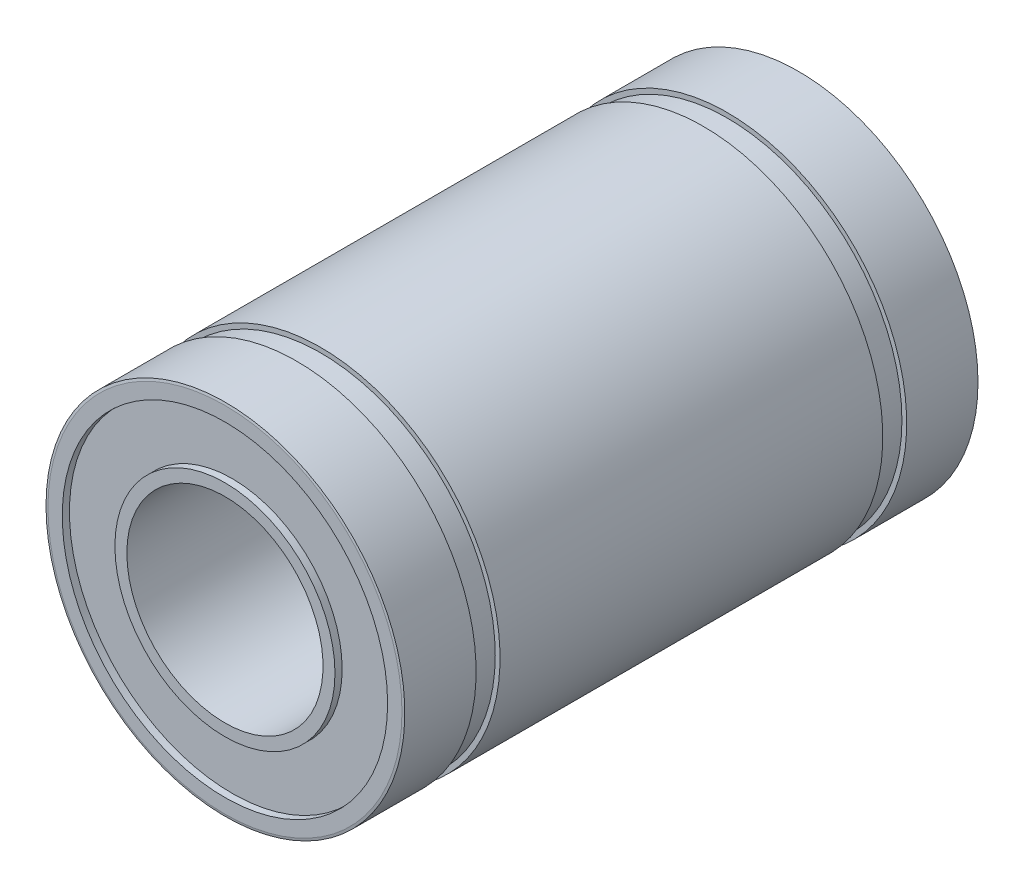
ISO-10303-21;
HEADER;
FILE_DESCRIPTION(('STEP AP214'),'2;1');
FILE_NAME('part.step','',(''),(''),'','','');
FILE_SCHEMA(('AUTOMOTIVE_DESIGN { 1 0 10303 214 1 1 1 1 }'));
ENDSEC;
DATA;
#1=APPLICATION_CONTEXT('core data for automotive mechanical design processes');
#2=APPLICATION_PROTOCOL_DEFINITION('international standard','automotive_design',2000,#1);
#3=PRODUCT_CONTEXT('',#1,'mechanical');
#4=PRODUCT('Part','Part','',(#3));
#5=PRODUCT_RELATED_PRODUCT_CATEGORY('part','',(#4));
#6=PRODUCT_DEFINITION_FORMATION('','',#4);
#7=PRODUCT_DEFINITION_CONTEXT('part definition',#1,'design');
#8=PRODUCT_DEFINITION('design','',#6,#7);
#9=PRODUCT_DEFINITION_SHAPE('','',#8);
#10=(LENGTH_UNIT() NAMED_UNIT(*) SI_UNIT(.MILLI.,.METRE.));
#11=(NAMED_UNIT(*) PLANE_ANGLE_UNIT() SI_UNIT($,.RADIAN.));
#12=(NAMED_UNIT(*) SI_UNIT($,.STERADIAN.) SOLID_ANGLE_UNIT());
#13=UNCERTAINTY_MEASURE_WITH_UNIT(LENGTH_MEASURE(1.E-05),#10,'distance_accuracy_value','');
#14=(GEOMETRIC_REPRESENTATION_CONTEXT(3) GLOBAL_UNCERTAINTY_ASSIGNED_CONTEXT((#13)) GLOBAL_UNIT_ASSIGNED_CONTEXT((#10,
#11,#12)) REPRESENTATION_CONTEXT('',''));
#15=CARTESIAN_POINT('',(0.,0.,0.));
#16=DIRECTION('',(0.,0.,1.));
#17=DIRECTION('',(1.,0.,0.));
#18=AXIS2_PLACEMENT_3D('',#15,#16,#17);
#19=CARTESIAN_POINT('',(0.,0.,24.));
#20=DIRECTION('',(0.,0.,-1.));
#21=DIRECTION('',(-1.,0.,0.));
#22=AXIS2_PLACEMENT_3D('',#19,#20,#21);
#23=CYLINDRICAL_SURFACE('',#22,4.1);
#24=CARTESIAN_POINT('',(0.,0.,0.));
#25=DIRECTION('',(0.,0.,-1.));
#26=DIRECTION('',(-1.,0.,0.));
#27=AXIS2_PLACEMENT_3D('',#24,#25,#26);
#28=CIRCLE('',#27,4.1);
#29=CARTESIAN_POINT('',(-4.1,0.,0.));
#30=VERTEX_POINT('',#29);
#31=EDGE_CURVE('E89',#30,#30,#28,.T.);
#32=ORIENTED_EDGE('',*,*,#31,.T.);
#33=EDGE_LOOP('',(#32));
#34=FACE_BOUND('',#33,.T.);
#35=CARTESIAN_POINT('',(0.,0.,24.));
#36=DIRECTION('',(0.,0.,-1.));
#37=DIRECTION('',(-1.,0.,0.));
#38=AXIS2_PLACEMENT_3D('',#35,#36,#37);
#39=CIRCLE('',#38,4.1);
#40=CARTESIAN_POINT('',(-4.1,0.,24.));
#41=VERTEX_POINT('',#40);
#42=EDGE_CURVE('E27',#41,#41,#39,.T.);
#43=ORIENTED_EDGE('',*,*,#42,.F.);
#44=EDGE_LOOP('',(#43));
#45=FACE_BOUND('',#44,.T.);
#46=ADVANCED_FACE('F24',(#34,#45),#23,.F.);
#47=CARTESIAN_POINT('',(0.,0.,24.));
#48=DIRECTION('',(0.,0.,1.));
#49=DIRECTION('',(1.,0.,0.));
#50=AXIS2_PLACEMENT_3D('',#47,#48,#49);
#51=PLANE('',#50);
#52=CARTESIAN_POINT('',(0.,0.,24.));
#53=DIRECTION('',(0.,0.,1.));
#54=DIRECTION('',(1.,0.,0.));
#55=AXIS2_PLACEMENT_3D('',#52,#53,#54);
#56=CIRCLE('',#55,4.6);
#57=CARTESIAN_POINT('',(4.6,0.,24.));
#58=VERTEX_POINT('',#57);
#59=EDGE_CURVE('E87',#58,#58,#56,.F.);
#60=ORIENTED_EDGE('',*,*,#59,.F.);
#61=EDGE_LOOP('',(#60));
#62=FACE_BOUND('',#61,.T.);
#63=ORIENTED_EDGE('',*,*,#42,.T.);
#64=EDGE_LOOP('',(#63));
#65=FACE_BOUND('',#64,.T.);
#66=ADVANCED_FACE('F96',(#62,#65),#51,.T.);
#67=CARTESIAN_POINT('',(0.,0.,0.));
#68=DIRECTION('',(0.,0.,1.));
#69=DIRECTION('',(1.,0.,0.));
#70=AXIS2_PLACEMENT_3D('',#67,#68,#69);
#71=PLANE('',#70);
#72=CARTESIAN_POINT('',(0.,0.,0.));
#73=DIRECTION('',(0.,0.,1.));
#74=DIRECTION('',(1.,0.,0.));
#75=AXIS2_PLACEMENT_3D('',#72,#73,#74);
#76=CIRCLE('',#75,4.6);
#77=CARTESIAN_POINT('',(4.6,0.,0.));
#78=VERTEX_POINT('',#77);
#79=EDGE_CURVE('E84',#78,#78,#76,.T.);
#80=ORIENTED_EDGE('',*,*,#79,.F.);
#81=EDGE_LOOP('',(#80));
#82=FACE_BOUND('',#81,.T.);
#83=ORIENTED_EDGE('',*,*,#31,.F.);
#84=EDGE_LOOP('',(#83));
#85=FACE_BOUND('',#84,.T.);
#86=ADVANCED_FACE('F102',(#82,#85),#71,.F.);
#87=CARTESIAN_POINT('',(0.,0.,24.));
#88=DIRECTION('',(0.,0.,1.));
#89=DIRECTION('',(1.,0.,0.));
#90=AXIS2_PLACEMENT_3D('',#87,#88,#89);
#91=CYLINDRICAL_SURFACE('',#90,4.6);
#92=CARTESIAN_POINT('',(0.,0.,23.7));
#93=DIRECTION('',(0.,0.,1.));
#94=DIRECTION('',(1.,0.,0.));
#95=AXIS2_PLACEMENT_3D('',#92,#93,#94);
#96=CIRCLE('',#95,4.6);
#97=CARTESIAN_POINT('',(4.6,0.,23.7));
#98=VERTEX_POINT('',#97);
#99=EDGE_CURVE('E81',#98,#98,#96,.F.);
#100=ORIENTED_EDGE('',*,*,#99,.F.);
#101=EDGE_LOOP('',(#100));
#102=FACE_BOUND('',#101,.T.);
#103=ORIENTED_EDGE('',*,*,#59,.T.);
#104=EDGE_LOOP('',(#103));
#105=FACE_BOUND('',#104,.T.);
#106=ADVANCED_FACE('F178',(#102,#105),#91,.T.);
#107=CARTESIAN_POINT('',(0.,0.,24.));
#108=DIRECTION('',(0.,0.,1.));
#109=DIRECTION('',(1.,0.,0.));
#110=AXIS2_PLACEMENT_3D('',#107,#108,#109);
#111=CYLINDRICAL_SURFACE('',#110,4.6);
#112=ORIENTED_EDGE('',*,*,#79,.T.);
#113=EDGE_LOOP('',(#112));
#114=FACE_BOUND('',#113,.T.);
#115=CARTESIAN_POINT('',(0.,0.,0.300000000000002));
#116=DIRECTION('',(0.,0.,1.));
#117=DIRECTION('',(1.,0.,0.));
#118=AXIS2_PLACEMENT_3D('',#115,#116,#117);
#119=CIRCLE('',#118,4.6);
#120=CARTESIAN_POINT('',(4.6,0.,0.300000000000002));
#121=VERTEX_POINT('',#120);
#122=EDGE_CURVE('E78',#121,#121,#119,.T.);
#123=ORIENTED_EDGE('',*,*,#122,.F.);
#124=EDGE_LOOP('',(#123));
#125=FACE_BOUND('',#124,.T.);
#126=ADVANCED_FACE('F174',(#114,#125),#111,.T.);
#127=CARTESIAN_POINT('',(-6.8,0.,23.7));
#128=DIRECTION('',(0.,0.,1.));
#129=DIRECTION('',(1.,0.,0.));
#130=AXIS2_PLACEMENT_3D('',#127,#128,#129);
#131=PLANE('',#130);
#132=ORIENTED_EDGE('',*,*,#99,.T.);
#133=EDGE_LOOP('',(#132));
#134=FACE_BOUND('',#133,.T.);
#135=CARTESIAN_POINT('',(0.,0.,23.7));
#136=DIRECTION('',(0.,0.,1.));
#137=DIRECTION('',(1.,0.,0.));
#138=AXIS2_PLACEMENT_3D('',#135,#136,#137);
#139=CIRCLE('',#138,6.8);
#140=CARTESIAN_POINT('',(6.8,0.,23.7));
#141=VERTEX_POINT('',#140);
#142=EDGE_CURVE('E75',#141,#141,#139,.T.);
#143=ORIENTED_EDGE('',*,*,#142,.T.);
#144=EDGE_LOOP('',(#143));
#145=FACE_BOUND('',#144,.T.);
#146=ADVANCED_FACE('F170',(#134,#145),#131,.T.);
#147=CARTESIAN_POINT('',(-6.8,0.,0.3));
#148=DIRECTION('',(0.,0.,-1.));
#149=DIRECTION('',(-1.,0.,0.));
#150=AXIS2_PLACEMENT_3D('',#147,#148,#149);
#151=PLANE('',#150);
#152=CARTESIAN_POINT('',(0.,0.,0.300000000000002));
#153=DIRECTION('',(0.,0.,1.));
#154=DIRECTION('',(1.,0.,0.));
#155=AXIS2_PLACEMENT_3D('',#152,#153,#154);
#156=CIRCLE('',#155,6.8);
#157=CARTESIAN_POINT('',(6.8,0.,0.300000000000002));
#158=VERTEX_POINT('',#157);
#159=EDGE_CURVE('E72',#158,#158,#156,.F.);
#160=ORIENTED_EDGE('',*,*,#159,.T.);
#161=EDGE_LOOP('',(#160));
#162=FACE_BOUND('',#161,.T.);
#163=ORIENTED_EDGE('',*,*,#122,.T.);
#164=EDGE_LOOP('',(#163));
#165=FACE_BOUND('',#164,.T.);
#166=ADVANCED_FACE('F166',(#162,#165),#151,.T.);
#167=CARTESIAN_POINT('',(0.,0.,24.));
#168=DIRECTION('',(0.,0.,1.));
#169=DIRECTION('',(1.,0.,0.));
#170=AXIS2_PLACEMENT_3D('',#167,#168,#169);
#171=CYLINDRICAL_SURFACE('',#170,6.8);
#172=CARTESIAN_POINT('',(0.,0.,24.));
#173=DIRECTION('',(0.,0.,1.));
#174=DIRECTION('',(1.,0.,0.));
#175=AXIS2_PLACEMENT_3D('',#172,#173,#174);
#176=CIRCLE('',#175,6.8);
#177=CARTESIAN_POINT('',(6.8,0.,24.));
#178=VERTEX_POINT('',#177);
#179=EDGE_CURVE('E69',#178,#178,#176,.F.);
#180=ORIENTED_EDGE('',*,*,#179,.F.);
#181=EDGE_LOOP('',(#180));
#182=FACE_BOUND('',#181,.T.);
#183=ORIENTED_EDGE('',*,*,#142,.F.);
#184=EDGE_LOOP('',(#183));
#185=FACE_BOUND('',#184,.T.);
#186=ADVANCED_FACE('F162',(#182,#185),#171,.F.);
#187=CARTESIAN_POINT('',(0.,0.,24.));
#188=DIRECTION('',(0.,0.,1.));
#189=DIRECTION('',(1.,0.,0.));
#190=AXIS2_PLACEMENT_3D('',#187,#188,#189);
#191=CYLINDRICAL_SURFACE('',#190,6.8);
#192=CARTESIAN_POINT('',(0.,0.,0.));
#193=DIRECTION('',(0.,0.,1.));
#194=DIRECTION('',(1.,0.,0.));
#195=AXIS2_PLACEMENT_3D('',#192,#193,#194);
#196=CIRCLE('',#195,6.8);
#197=CARTESIAN_POINT('',(6.8,0.,0.));
#198=VERTEX_POINT('',#197);
#199=EDGE_CURVE('E66',#198,#198,#196,.F.);
#200=ORIENTED_EDGE('',*,*,#199,.T.);
#201=EDGE_LOOP('',(#200));
#202=FACE_BOUND('',#201,.T.);
#203=ORIENTED_EDGE('',*,*,#159,.F.);
#204=EDGE_LOOP('',(#203));
#205=FACE_BOUND('',#204,.T.);
#206=ADVANCED_FACE('F158',(#202,#205),#191,.F.);
#207=CARTESIAN_POINT('',(0.,0.,24.));
#208=DIRECTION('',(0.,0.,1.));
#209=DIRECTION('',(1.,0.,0.));
#210=AXIS2_PLACEMENT_3D('',#207,#208,#209);
#211=PLANE('',#210);
#212=CARTESIAN_POINT('',(0.,0.,24.));
#213=DIRECTION('',(0.,0.,-1.));
#214=DIRECTION('',(-1.,0.,0.));
#215=AXIS2_PLACEMENT_3D('',#212,#213,#214);
#216=CIRCLE('',#215,7.4);
#217=CARTESIAN_POINT('',(-7.4,0.,24.));
#218=VERTEX_POINT('',#217);
#219=EDGE_CURVE('E63',#218,#218,#216,.T.);
#220=ORIENTED_EDGE('',*,*,#219,.F.);
#221=EDGE_LOOP('',(#220));
#222=FACE_BOUND('',#221,.T.);
#223=ORIENTED_EDGE('',*,*,#179,.T.);
#224=EDGE_LOOP('',(#223));
#225=FACE_BOUND('',#224,.T.);
#226=ADVANCED_FACE('F154',(#222,#225),#211,.T.);
#227=CARTESIAN_POINT('',(0.,0.,0.));
#228=DIRECTION('',(0.,0.,1.));
#229=DIRECTION('',(1.,0.,0.));
#230=AXIS2_PLACEMENT_3D('',#227,#228,#229);
#231=PLANE('',#230);
#232=CARTESIAN_POINT('',(0.,0.,0.));
#233=DIRECTION('',(0.,0.,1.));
#234=DIRECTION('',(1.,0.,0.));
#235=AXIS2_PLACEMENT_3D('',#232,#233,#234);
#236=CIRCLE('',#235,7.4);
#237=CARTESIAN_POINT('',(7.4,0.,0.));
#238=VERTEX_POINT('',#237);
#239=EDGE_CURVE('E60',#238,#238,#236,.T.);
#240=ORIENTED_EDGE('',*,*,#239,.F.);
#241=EDGE_LOOP('',(#240));
#242=FACE_BOUND('',#241,.T.);
#243=ORIENTED_EDGE('',*,*,#199,.F.);
#244=EDGE_LOOP('',(#243));
#245=FACE_BOUND('',#244,.T.);
#246=ADVANCED_FACE('F150',(#242,#245),#231,.F.);
#247=CARTESIAN_POINT('',(0.,0.,23.98));
#248=DIRECTION('',(0.,0.,-1.));
#249=DIRECTION('',(-1.,0.,0.));
#250=AXIS2_PLACEMENT_3D('',#247,#248,#249);
#251=CONICAL_SURFACE('',#250,7.5,1.37340076694502);
#252=ORIENTED_EDGE('',*,*,#219,.T.);
#253=EDGE_LOOP('',(#252));
#254=FACE_BOUND('',#253,.T.);
#255=CARTESIAN_POINT('',(0.,0.,23.98));
#256=DIRECTION('',(0.,0.,-1.));
#257=DIRECTION('',(-1.,0.,0.));
#258=AXIS2_PLACEMENT_3D('',#255,#256,#257);
#259=CIRCLE('',#258,7.5);
#260=CARTESIAN_POINT('',(-7.5,0.,23.98));
#261=VERTEX_POINT('',#260);
#262=EDGE_CURVE('E39',#261,#261,#259,.T.);
#263=ORIENTED_EDGE('',*,*,#262,.F.);
#264=EDGE_LOOP('',(#263));
#265=FACE_BOUND('',#264,.T.);
#266=ADVANCED_FACE('F146',(#254,#265),#251,.T.);
#267=CARTESIAN_POINT('',(0.,0.,0.0199999999999992));
#268=DIRECTION('',(0.,0.,1.));
#269=DIRECTION('',(1.,0.,0.));
#270=AXIS2_PLACEMENT_3D('',#267,#268,#269);
#271=CONICAL_SURFACE('',#270,7.5,1.37340076694502);
#272=CARTESIAN_POINT('',(0.,0.,0.0199999999999992));
#273=DIRECTION('',(0.,0.,-1.));
#274=DIRECTION('',(-1.,0.,0.));
#275=AXIS2_PLACEMENT_3D('',#272,#273,#274);
#276=CIRCLE('',#275,7.5);
#277=CARTESIAN_POINT('',(-7.5,0.,0.0199999999999992));
#278=VERTEX_POINT('',#277);
#279=EDGE_CURVE('E59',#278,#278,#276,.F.);
#280=ORIENTED_EDGE('',*,*,#279,.F.);
#281=EDGE_LOOP('',(#280));
#282=FACE_BOUND('',#281,.T.);
#283=ORIENTED_EDGE('',*,*,#239,.T.);
#284=EDGE_LOOP('',(#283));
#285=FACE_BOUND('',#284,.T.);
#286=ADVANCED_FACE('F142',(#282,#285),#271,.T.);
#287=CARTESIAN_POINT('',(0.,0.,24.));
#288=DIRECTION('',(0.,0.,-1.));
#289=DIRECTION('',(-1.,0.,0.));
#290=AXIS2_PLACEMENT_3D('',#287,#288,#289);
#291=CYLINDRICAL_SURFACE('',#290,7.5);
#292=ORIENTED_EDGE('',*,*,#262,.T.);
#293=EDGE_LOOP('',(#292));
#294=FACE_BOUND('',#293,.T.);
#295=CARTESIAN_POINT('',(0.,0.,21.));
#296=DIRECTION('',(0.,0.,-1.));
#297=DIRECTION('',(-1.,0.,0.));
#298=AXIS2_PLACEMENT_3D('',#295,#296,#297);
#299=CIRCLE('',#298,7.5);
#300=CARTESIAN_POINT('',(-7.5,0.,21.));
#301=VERTEX_POINT('',#300);
#302=EDGE_CURVE('E56',#301,#301,#299,.T.);
#303=ORIENTED_EDGE('',*,*,#302,.F.);
#304=EDGE_LOOP('',(#303));
#305=FACE_BOUND('',#304,.T.);
#306=ADVANCED_FACE('F138',(#294,#305),#291,.T.);
#307=CARTESIAN_POINT('',(0.,0.,24.));
#308=DIRECTION('',(0.,0.,-1.));
#309=DIRECTION('',(-1.,0.,0.));
#310=AXIS2_PLACEMENT_3D('',#307,#308,#309);
#311=CYLINDRICAL_SURFACE('',#310,7.5);
#312=ORIENTED_EDGE('',*,*,#279,.T.);
#313=EDGE_LOOP('',(#312));
#314=FACE_BOUND('',#313,.T.);
#315=CARTESIAN_POINT('',(0.,0.,3.));
#316=DIRECTION('',(0.,0.,-1.));
#317=DIRECTION('',(-1.,0.,0.));
#318=AXIS2_PLACEMENT_3D('',#315,#316,#317);
#319=CIRCLE('',#318,7.5);
#320=CARTESIAN_POINT('',(-7.5,0.,3.));
#321=VERTEX_POINT('',#320);
#322=EDGE_CURVE('E53',#321,#321,#319,.F.);
#323=ORIENTED_EDGE('',*,*,#322,.F.);
#324=EDGE_LOOP('',(#323));
#325=FACE_BOUND('',#324,.T.);
#326=ADVANCED_FACE('F134',(#314,#325),#311,.T.);
#327=CARTESIAN_POINT('',(-7.7,0.,21.));
#328=DIRECTION('',(0.,0.,-1.));
#329=DIRECTION('',(-1.,0.,0.));
#330=AXIS2_PLACEMENT_3D('',#327,#328,#329);
#331=PLANE('',#330);
#332=ORIENTED_EDGE('',*,*,#302,.T.);
#333=EDGE_LOOP('',(#332));
#334=FACE_BOUND('',#333,.T.);
#335=CARTESIAN_POINT('',(0.,0.,21.));
#336=DIRECTION('',(0.,0.,1.));
#337=DIRECTION('',(1.,0.,0.));
#338=AXIS2_PLACEMENT_3D('',#335,#336,#337);
#339=CIRCLE('',#338,7.3);
#340=CARTESIAN_POINT('',(7.3,0.,21.));
#341=VERTEX_POINT('',#340);
#342=EDGE_CURVE('E50',#341,#341,#339,.F.);
#343=ORIENTED_EDGE('',*,*,#342,.F.);
#344=EDGE_LOOP('',(#343));
#345=FACE_BOUND('',#344,.T.);
#346=ADVANCED_FACE('F130',(#334,#345),#331,.T.);
#347=CARTESIAN_POINT('',(-7.7,0.,3.));
#348=DIRECTION('',(0.,0.,1.));
#349=DIRECTION('',(1.,0.,0.));
#350=AXIS2_PLACEMENT_3D('',#347,#348,#349);
#351=PLANE('',#350);
#352=ORIENTED_EDGE('',*,*,#322,.T.);
#353=EDGE_LOOP('',(#352));
#354=FACE_BOUND('',#353,.T.);
#355=CARTESIAN_POINT('',(0.,0.,3.));
#356=DIRECTION('',(0.,0.,1.));
#357=DIRECTION('',(1.,0.,0.));
#358=AXIS2_PLACEMENT_3D('',#355,#356,#357);
#359=CIRCLE('',#358,7.3);
#360=CARTESIAN_POINT('',(7.3,0.,3.));
#361=VERTEX_POINT('',#360);
#362=EDGE_CURVE('E47',#361,#361,#359,.T.);
#363=ORIENTED_EDGE('',*,*,#362,.F.);
#364=EDGE_LOOP('',(#363));
#365=FACE_BOUND('',#364,.T.);
#366=ADVANCED_FACE('F126',(#354,#365),#351,.T.);
#367=CARTESIAN_POINT('',(0.,0.,24.));
#368=DIRECTION('',(0.,0.,1.));
#369=DIRECTION('',(1.,0.,0.));
#370=AXIS2_PLACEMENT_3D('',#367,#368,#369);
#371=CYLINDRICAL_SURFACE('',#370,7.3);
#372=CARTESIAN_POINT('',(0.,0.,20.));
#373=DIRECTION('',(0.,0.,1.));
#374=DIRECTION('',(1.,0.,0.));
#375=AXIS2_PLACEMENT_3D('',#372,#373,#374);
#376=CIRCLE('',#375,7.3);
#377=CARTESIAN_POINT('',(7.3,0.,20.));
#378=VERTEX_POINT('',#377);
#379=EDGE_CURVE('E44',#378,#378,#376,.F.);
#380=ORIENTED_EDGE('',*,*,#379,.F.);
#381=EDGE_LOOP('',(#380));
#382=FACE_BOUND('',#381,.T.);
#383=ORIENTED_EDGE('',*,*,#342,.T.);
#384=EDGE_LOOP('',(#383));
#385=FACE_BOUND('',#384,.T.);
#386=ADVANCED_FACE('F122',(#382,#385),#371,.T.);
#387=CARTESIAN_POINT('',(0.,0.,24.));
#388=DIRECTION('',(0.,0.,1.));
#389=DIRECTION('',(1.,0.,0.));
#390=AXIS2_PLACEMENT_3D('',#387,#388,#389);
#391=CYLINDRICAL_SURFACE('',#390,7.3);
#392=ORIENTED_EDGE('',*,*,#362,.T.);
#393=EDGE_LOOP('',(#392));
#394=FACE_BOUND('',#393,.T.);
#395=CARTESIAN_POINT('',(0.,0.,4.));
#396=DIRECTION('',(0.,0.,1.));
#397=DIRECTION('',(1.,0.,0.));
#398=AXIS2_PLACEMENT_3D('',#395,#396,#397);
#399=CIRCLE('',#398,7.3);
#400=CARTESIAN_POINT('',(7.3,0.,4.));
#401=VERTEX_POINT('',#400);
#402=EDGE_CURVE('E36',#401,#401,#399,.T.);
#403=ORIENTED_EDGE('',*,*,#402,.F.);
#404=EDGE_LOOP('',(#403));
#405=FACE_BOUND('',#404,.T.);
#406=ADVANCED_FACE('F118',(#394,#405),#391,.T.);
#407=CARTESIAN_POINT('',(-7.7,0.,20.));
#408=DIRECTION('',(0.,0.,1.));
#409=DIRECTION('',(1.,0.,0.));
#410=AXIS2_PLACEMENT_3D('',#407,#408,#409);
#411=PLANE('',#410);
#412=CARTESIAN_POINT('',(0.,0.,20.));
#413=DIRECTION('',(0.,0.,-1.));
#414=DIRECTION('',(-1.,0.,0.));
#415=AXIS2_PLACEMENT_3D('',#412,#413,#414);
#416=CIRCLE('',#415,7.5);
#417=CARTESIAN_POINT('',(-7.5,0.,20.));
#418=VERTEX_POINT('',#417);
#419=EDGE_CURVE('E31',#418,#418,#416,.T.);
#420=ORIENTED_EDGE('',*,*,#419,.F.);
#421=EDGE_LOOP('',(#420));
#422=FACE_BOUND('',#421,.T.);
#423=ORIENTED_EDGE('',*,*,#379,.T.);
#424=EDGE_LOOP('',(#423));
#425=FACE_BOUND('',#424,.T.);
#426=ADVANCED_FACE('F111',(#422,#425),#411,.T.);
#427=CARTESIAN_POINT('',(-7.7,0.,4.));
#428=DIRECTION('',(0.,0.,-1.));
#429=DIRECTION('',(-1.,0.,0.));
#430=AXIS2_PLACEMENT_3D('',#427,#428,#429);
#431=PLANE('',#430);
#432=CARTESIAN_POINT('',(0.,0.,4.));
#433=DIRECTION('',(0.,0.,-1.));
#434=DIRECTION('',(-1.,0.,0.));
#435=AXIS2_PLACEMENT_3D('',#432,#433,#434);
#436=CIRCLE('',#435,7.5);
#437=CARTESIAN_POINT('',(-7.5,0.,4.));
#438=VERTEX_POINT('',#437);
#439=EDGE_CURVE('E12',#438,#438,#436,.F.);
#440=ORIENTED_EDGE('',*,*,#439,.F.);
#441=EDGE_LOOP('',(#440));
#442=FACE_BOUND('',#441,.T.);
#443=ORIENTED_EDGE('',*,*,#402,.T.);
#444=EDGE_LOOP('',(#443));
#445=FACE_BOUND('',#444,.T.);
#446=ADVANCED_FACE('F106',(#442,#445),#431,.T.);
#447=CARTESIAN_POINT('',(0.,0.,24.));
#448=DIRECTION('',(0.,0.,-1.));
#449=DIRECTION('',(-1.,0.,0.));
#450=AXIS2_PLACEMENT_3D('',#447,#448,#449);
#451=CYLINDRICAL_SURFACE('',#450,7.5);
#452=ORIENTED_EDGE('',*,*,#439,.T.);
#453=EDGE_LOOP('',(#452));
#454=FACE_BOUND('',#453,.T.);
#455=ORIENTED_EDGE('',*,*,#419,.T.);
#456=EDGE_LOOP('',(#455));
#457=FACE_BOUND('',#456,.T.);
#458=ADVANCED_FACE('F104',(#454,#457),#451,.T.);
#459=CLOSED_SHELL('',(#46,#66,#86,#106,#126,#146,#166,#186,#206,#226,#246,#266,#286,#306,#326,
#346,#366,#386,#406,#426,#446,#458));
#460=MANIFOLD_SOLID_BREP('B1',#459);
#461=ADVANCED_BREP_SHAPE_REPRESENTATION('',(#18,#460),#14);
#462=SHAPE_DEFINITION_REPRESENTATION(#9,#461);
ENDSEC;
END-ISO-10303-21;
